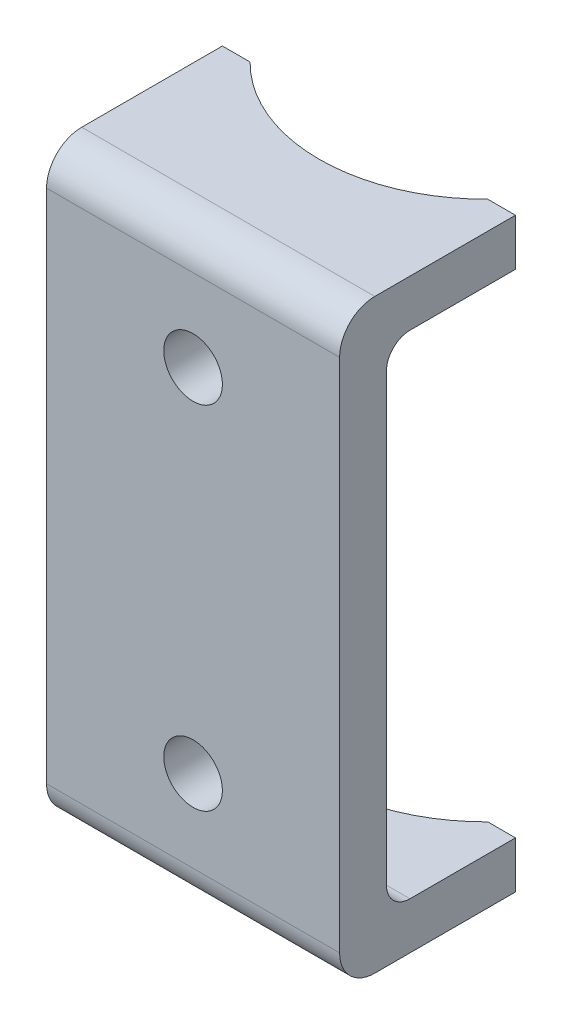
ISO-10303-21;
HEADER;
FILE_DESCRIPTION(('STEP AP214'),'2;1');
FILE_NAME('part.step','',(''),(''),'','','');
FILE_SCHEMA(('AUTOMOTIVE_DESIGN { 1 0 10303 214 1 1 1 1 }'));
ENDSEC;
DATA;
#1=APPLICATION_CONTEXT('core data for automotive mechanical design processes');
#2=APPLICATION_PROTOCOL_DEFINITION('international standard','automotive_design',2000,#1);
#3=PRODUCT_CONTEXT('',#1,'mechanical');
#4=PRODUCT('Part','Part','',(#3));
#5=PRODUCT_RELATED_PRODUCT_CATEGORY('part','',(#4));
#6=PRODUCT_DEFINITION_FORMATION('','',#4);
#7=PRODUCT_DEFINITION_CONTEXT('part definition',#1,'design');
#8=PRODUCT_DEFINITION('design','',#6,#7);
#9=PRODUCT_DEFINITION_SHAPE('','',#8);
#10=(LENGTH_UNIT() NAMED_UNIT(*) SI_UNIT(.MILLI.,.METRE.));
#11=(NAMED_UNIT(*) PLANE_ANGLE_UNIT() SI_UNIT($,.RADIAN.));
#12=(NAMED_UNIT(*) SI_UNIT($,.STERADIAN.) SOLID_ANGLE_UNIT());
#13=UNCERTAINTY_MEASURE_WITH_UNIT(LENGTH_MEASURE(1.E-05),#10,'distance_accuracy_value','');
#14=(GEOMETRIC_REPRESENTATION_CONTEXT(3) GLOBAL_UNCERTAINTY_ASSIGNED_CONTEXT((#13)) GLOBAL_UNIT_ASSIGNED_CONTEXT((#10,
#11,#12)) REPRESENTATION_CONTEXT('',''));
#15=CARTESIAN_POINT('',(0.,0.,0.));
#16=DIRECTION('',(0.,0.,1.));
#17=DIRECTION('',(1.,0.,0.));
#18=AXIS2_PLACEMENT_3D('',#15,#16,#17);
#19=CARTESIAN_POINT('',(12.5,-21.,-15.));
#20=DIRECTION('',(0.,0.,1.));
#21=DIRECTION('',(0.,-1.,0.));
#22=AXIS2_PLACEMENT_3D('',#19,#20,#21);
#23=PLANE('',#22);
#24=DIRECTION('',(-1.,0.,0.));
#25=VECTOR('',#24,1.);
#26=CARTESIAN_POINT('',(12.5,-25.,-15.));
#27=LINE('',#26,#25);
#28=CARTESIAN_POINT('',(12.5,-25.,-15.));
#29=VERTEX_POINT('',#28);
#30=CARTESIAN_POINT('',(10.1359961743084,-25.,-15.));
#31=VERTEX_POINT('',#30);
#32=EDGE_CURVE('E157',#29,#31,#27,.T.);
#33=ORIENTED_EDGE('',*,*,#32,.T.);
#34=DIRECTION('',(0.,1.,0.));
#35=VECTOR('',#34,1.);
#36=CARTESIAN_POINT('',(10.1359961743084,-25.,-15.));
#37=LINE('',#36,#35);
#38=CARTESIAN_POINT('',(10.1359961743084,-21.,-15.));
#39=VERTEX_POINT('',#38);
#40=EDGE_CURVE('E142',#31,#39,#37,.T.);
#41=ORIENTED_EDGE('',*,*,#40,.T.);
#42=DIRECTION('',(-1.,0.,0.));
#43=VECTOR('',#42,1.);
#44=CARTESIAN_POINT('',(12.5,-21.,-15.));
#45=LINE('',#44,#43);
#46=CARTESIAN_POINT('',(12.5,-21.,-15.));
#47=VERTEX_POINT('',#46);
#48=EDGE_CURVE('E165',#47,#39,#45,.T.);
#49=ORIENTED_EDGE('',*,*,#48,.F.);
#50=DIRECTION('',(0.,1.,0.));
#51=VECTOR('',#50,1.);
#52=CARTESIAN_POINT('',(12.5,-21.,-15.));
#53=LINE('',#52,#51);
#54=EDGE_CURVE('E162',#29,#47,#53,.T.);
#55=ORIENTED_EDGE('',*,*,#54,.F.);
#56=EDGE_LOOP('',(#33,#41,#49,#55));
#57=FACE_BOUND('',#56,.T.);
#58=ADVANCED_FACE('F32',(#57),#23,.F.);
#59=CARTESIAN_POINT('',(12.5,25.,-15.));
#60=DIRECTION('',(0.,0.,1.));
#61=DIRECTION('',(0.,-1.,0.));
#62=AXIS2_PLACEMENT_3D('',#59,#60,#61);
#63=PLANE('',#62);
#64=DIRECTION('',(-1.,0.,0.));
#65=VECTOR('',#64,1.);
#66=CARTESIAN_POINT('',(12.5,21.,-15.));
#67=LINE('',#66,#65);
#68=CARTESIAN_POINT('',(12.5,21.,-15.));
#69=VERTEX_POINT('',#68);
#70=CARTESIAN_POINT('',(10.1359961743084,21.,-15.));
#71=VERTEX_POINT('',#70);
#72=EDGE_CURVE('E181',#69,#71,#67,.T.);
#73=ORIENTED_EDGE('',*,*,#72,.T.);
#74=DIRECTION('',(0.,1.,0.));
#75=VECTOR('',#74,1.);
#76=CARTESIAN_POINT('',(10.1359961743084,-25.,-14.9999999999999));
#77=LINE('',#76,#75);
#78=CARTESIAN_POINT('',(10.1359961743084,25.,-15.));
#79=VERTEX_POINT('',#78);
#80=EDGE_CURVE('E263',#71,#79,#77,.T.);
#81=ORIENTED_EDGE('',*,*,#80,.T.);
#82=DIRECTION('',(-1.,0.,0.));
#83=VECTOR('',#82,1.);
#84=CARTESIAN_POINT('',(12.5,25.,-15.));
#85=LINE('',#84,#83);
#86=CARTESIAN_POINT('',(12.5,25.,-15.));
#87=VERTEX_POINT('',#86);
#88=EDGE_CURVE('E185',#87,#79,#85,.T.);
#89=ORIENTED_EDGE('',*,*,#88,.F.);
#90=DIRECTION('',(0.,1.,0.));
#91=VECTOR('',#90,1.);
#92=CARTESIAN_POINT('',(12.5,25.,-15.));
#93=LINE('',#92,#91);
#94=EDGE_CURVE('E234',#69,#87,#93,.T.);
#95=ORIENTED_EDGE('',*,*,#94,.F.);
#96=EDGE_LOOP('',(#73,#81,#89,#95));
#97=FACE_BOUND('',#96,.T.);
#98=ADVANCED_FACE('F302',(#97),#63,.F.);
#99=CARTESIAN_POINT('',(12.5,-22.,-3.00000000000001));
#100=DIRECTION('',(-1.,0.,0.));
#101=DIRECTION('',(0.,0.,1.));
#102=AXIS2_PLACEMENT_3D('',#99,#100,#101);
#103=CYLINDRICAL_SURFACE('',#102,3.);
#104=CARTESIAN_POINT('',(-12.5,-22.,-3.00000000000001));
#105=DIRECTION('',(1.,0.,0.));
#106=DIRECTION('',(0.,0.,-1.));
#107=AXIS2_PLACEMENT_3D('',#104,#105,#106);
#108=CIRCLE('',#107,3.);
#109=CARTESIAN_POINT('',(-12.5,-22.,0.));
#110=VERTEX_POINT('',#109);
#111=CARTESIAN_POINT('',(-12.5,-25.,-3.00000000000003));
#112=VERTEX_POINT('',#111);
#113=EDGE_CURVE('E225',#110,#112,#108,.T.);
#114=ORIENTED_EDGE('',*,*,#113,.T.);
#115=DIRECTION('',(-1.,0.,0.));
#116=VECTOR('',#115,1.);
#117=CARTESIAN_POINT('',(12.5,-25.,-3.00000000000003));
#118=LINE('',#117,#116);
#119=CARTESIAN_POINT('',(12.5,-25.,-3.00000000000003));
#120=VERTEX_POINT('',#119);
#121=EDGE_CURVE('E40',#120,#112,#118,.T.);
#122=ORIENTED_EDGE('',*,*,#121,.F.);
#123=CARTESIAN_POINT('',(12.5,-22.,-3.00000000000001));
#124=DIRECTION('',(1.,0.,0.));
#125=DIRECTION('',(0.,0.,-1.));
#126=AXIS2_PLACEMENT_3D('',#123,#124,#125);
#127=CIRCLE('',#126,3.);
#128=CARTESIAN_POINT('',(12.5,-22.,0.));
#129=VERTEX_POINT('',#128);
#130=EDGE_CURVE('E201',#129,#120,#127,.T.);
#131=ORIENTED_EDGE('',*,*,#130,.F.);
#132=DIRECTION('',(-1.,0.,0.));
#133=VECTOR('',#132,1.);
#134=CARTESIAN_POINT('',(12.5,-22.,0.));
#135=LINE('',#134,#133);
#136=EDGE_CURVE('E195',#129,#110,#135,.T.);
#137=ORIENTED_EDGE('',*,*,#136,.T.);
#138=EDGE_LOOP('',(#114,#122,#131,#137));
#139=FACE_BOUND('',#138,.T.);
#140=ADVANCED_FACE('F34',(#139),#103,.T.);
#141=CARTESIAN_POINT('',(12.5,-25.,-15.));
#142=DIRECTION('',(0.,1.,0.));
#143=DIRECTION('',(0.,0.,1.));
#144=AXIS2_PLACEMENT_3D('',#141,#142,#143);
#145=PLANE('',#144);
#146=CARTESIAN_POINT('',(-10.1359961743084,-25.,-15.));
#147=VERTEX_POINT('',#146);
#148=CARTESIAN_POINT('',(-12.5,-25.,-15.));
#149=VERTEX_POINT('',#148);
#150=EDGE_CURVE('E160',#147,#149,#27,.T.);
#151=ORIENTED_EDGE('',*,*,#150,.F.);
#152=CARTESIAN_POINT('',(0.,-25.,-25.));
#153=DIRECTION('',(0.,1.,0.));
#154=DIRECTION('',(0.,0.,1.));
#155=AXIS2_PLACEMENT_3D('',#152,#153,#154);
#156=CIRCLE('',#155,14.2386241767102);
#157=EDGE_CURVE('E145',#147,#31,#156,.T.);
#158=ORIENTED_EDGE('',*,*,#157,.T.);
#159=ORIENTED_EDGE('',*,*,#32,.F.);
#160=DIRECTION('',(0.,0.,-1.));
#161=VECTOR('',#160,1.);
#162=CARTESIAN_POINT('',(12.5,-25.,-15.));
#163=LINE('',#162,#161);
#164=EDGE_CURVE('E247',#120,#29,#163,.T.);
#165=ORIENTED_EDGE('',*,*,#164,.F.);
#166=ORIENTED_EDGE('',*,*,#121,.T.);
#167=DIRECTION('',(0.,0.,-1.));
#168=VECTOR('',#167,1.);
#169=CARTESIAN_POINT('',(-12.5,-25.,-15.));
#170=LINE('',#169,#168);
#171=EDGE_CURVE('E223',#112,#149,#170,.T.);
#172=ORIENTED_EDGE('',*,*,#171,.T.);
#173=EDGE_LOOP('',(#151,#158,#159,#165,#166,#172));
#174=FACE_BOUND('',#173,.T.);
#175=ADVANCED_FACE('F156',(#174),#145,.F.);
#176=CARTESIAN_POINT('',(-10.1359961743084,-21.,-15.));
#177=VERTEX_POINT('',#176);
#178=CARTESIAN_POINT('',(-12.5,-21.,-15.));
#179=VERTEX_POINT('',#178);
#180=EDGE_CURVE('E168',#177,#179,#45,.T.);
#181=ORIENTED_EDGE('',*,*,#180,.F.);
#182=DIRECTION('',(0.,1.,0.));
#183=VECTOR('',#182,1.);
#184=CARTESIAN_POINT('',(-10.1359961743084,-25.,-15.));
#185=LINE('',#184,#183);
#186=EDGE_CURVE('E47',#177,#147,#185,.F.);
#187=ORIENTED_EDGE('',*,*,#186,.T.);
#188=ORIENTED_EDGE('',*,*,#150,.T.);
#189=DIRECTION('',(0.,1.,0.));
#190=VECTOR('',#189,1.);
#191=CARTESIAN_POINT('',(-12.5,-21.,-15.));
#192=LINE('',#191,#190);
#193=EDGE_CURVE('E220',#149,#179,#192,.T.);
#194=ORIENTED_EDGE('',*,*,#193,.T.);
#195=EDGE_LOOP('',(#181,#187,#188,#194));
#196=FACE_BOUND('',#195,.T.);
#197=ADVANCED_FACE('F316',(#196),#23,.F.);
#198=CARTESIAN_POINT('',(12.5,-21.,-6.00000000000002));
#199=DIRECTION('',(0.,-1.,0.));
#200=DIRECTION('',(0.,0.,-1.));
#201=AXIS2_PLACEMENT_3D('',#198,#199,#200);
#202=PLANE('',#201);
#203=ORIENTED_EDGE('',*,*,#48,.T.);
#204=CARTESIAN_POINT('',(0.,-21.,-25.));
#205=DIRECTION('',(0.,-1.,0.));
#206=DIRECTION('',(0.,0.,-1.));
#207=AXIS2_PLACEMENT_3D('',#204,#205,#206);
#208=CIRCLE('',#207,14.2386241767102);
#209=EDGE_CURVE('E146',#39,#177,#208,.T.);
#210=ORIENTED_EDGE('',*,*,#209,.T.);
#211=ORIENTED_EDGE('',*,*,#180,.T.);
#212=DIRECTION('',(0.,0.,1.));
#213=VECTOR('',#212,1.);
#214=CARTESIAN_POINT('',(-12.5,-21.,-6.00000000000002));
#215=LINE('',#214,#213);
#216=CARTESIAN_POINT('',(-12.5,-21.,-6.00000000000002));
#217=VERTEX_POINT('',#216);
#218=EDGE_CURVE('E218',#179,#217,#215,.T.);
#219=ORIENTED_EDGE('',*,*,#218,.T.);
#220=DIRECTION('',(-1.,0.,0.));
#221=VECTOR('',#220,1.);
#222=CARTESIAN_POINT('',(12.5,-21.,-6.00000000000002));
#223=LINE('',#222,#221);
#224=CARTESIAN_POINT('',(12.5,-21.,-6.00000000000002));
#225=VERTEX_POINT('',#224);
#226=EDGE_CURVE('E169',#225,#217,#223,.T.);
#227=ORIENTED_EDGE('',*,*,#226,.F.);
#228=DIRECTION('',(0.,0.,1.));
#229=VECTOR('',#228,1.);
#230=CARTESIAN_POINT('',(12.5,-21.,-6.00000000000002));
#231=LINE('',#230,#229);
#232=EDGE_CURVE('E244',#47,#225,#231,.T.);
#233=ORIENTED_EDGE('',*,*,#232,.F.);
#234=EDGE_LOOP('',(#203,#210,#211,#219,#227,#233));
#235=FACE_BOUND('',#234,.T.);
#236=ADVANCED_FACE('F323',(#235),#202,.F.);
#237=CARTESIAN_POINT('',(12.5,-19.,-6.00000000000001));
#238=DIRECTION('',(-1.,0.,0.));
#239=DIRECTION('',(0.,0.,1.));
#240=AXIS2_PLACEMENT_3D('',#237,#238,#239);
#241=CYLINDRICAL_SURFACE('',#240,2.);
#242=CARTESIAN_POINT('',(-12.5,-19.,-6.00000000000001));
#243=DIRECTION('',(-1.,0.,0.));
#244=DIRECTION('',(0.,0.,-1.));
#245=AXIS2_PLACEMENT_3D('',#242,#243,#244);
#246=CIRCLE('',#245,2.);
#247=CARTESIAN_POINT('',(-12.5,-19.,-4.00000000000001));
#248=VERTEX_POINT('',#247);
#249=EDGE_CURVE('E216',#217,#248,#246,.T.);
#250=ORIENTED_EDGE('',*,*,#249,.T.);
#251=DIRECTION('',(-1.,0.,0.));
#252=VECTOR('',#251,1.);
#253=CARTESIAN_POINT('',(12.5,-19.,-4.00000000000001));
#254=LINE('',#253,#252);
#255=CARTESIAN_POINT('',(12.5,-19.,-4.00000000000001));
#256=VERTEX_POINT('',#255);
#257=EDGE_CURVE('E172',#256,#248,#254,.T.);
#258=ORIENTED_EDGE('',*,*,#257,.F.);
#259=CARTESIAN_POINT('',(12.5,-19.,-6.00000000000001));
#260=DIRECTION('',(-1.,0.,0.));
#261=DIRECTION('',(0.,0.,-1.));
#262=AXIS2_PLACEMENT_3D('',#259,#260,#261);
#263=CIRCLE('',#262,2.);
#264=EDGE_CURVE('E242',#225,#256,#263,.T.);
#265=ORIENTED_EDGE('',*,*,#264,.F.);
#266=ORIENTED_EDGE('',*,*,#226,.T.);
#267=EDGE_LOOP('',(#250,#258,#265,#266));
#268=FACE_BOUND('',#267,.T.);
#269=ADVANCED_FACE('F329',(#268),#241,.F.);
#270=CARTESIAN_POINT('',(12.5,19.,-4.));
#271=DIRECTION('',(0.,0.,1.));
#272=DIRECTION('',(0.,-1.,0.));
#273=AXIS2_PLACEMENT_3D('',#270,#271,#272);
#274=PLANE('',#273);
#275=CARTESIAN_POINT('',(0.,-15.,-4.00000000000001));
#276=DIRECTION('',(0.,0.,1.));
#277=DIRECTION('',(0.,-1.,0.));
#278=AXIS2_PLACEMENT_3D('',#275,#276,#277);
#279=CIRCLE('',#278,2.5);
#280=CARTESIAN_POINT('',(0.,-17.5,-4.00000000000001));
#281=VERTEX_POINT('',#280);
#282=EDGE_CURVE('E256',#281,#281,#279,.F.);
#283=ORIENTED_EDGE('',*,*,#282,.F.);
#284=EDGE_LOOP('',(#283));
#285=FACE_BOUND('',#284,.T.);
#286=CARTESIAN_POINT('',(0.,15.,-4.));
#287=DIRECTION('',(0.,0.,1.));
#288=DIRECTION('',(0.,-1.,0.));
#289=AXIS2_PLACEMENT_3D('',#286,#287,#288);
#290=CIRCLE('',#289,2.5);
#291=CARTESIAN_POINT('',(0.,12.5,-4.));
#292=VERTEX_POINT('',#291);
#293=EDGE_CURVE('E228',#292,#292,#290,.F.);
#294=ORIENTED_EDGE('',*,*,#293,.F.);
#295=EDGE_LOOP('',(#294));
#296=FACE_BOUND('',#295,.T.);
#297=DIRECTION('',(0.,1.,0.));
#298=VECTOR('',#297,1.);
#299=CARTESIAN_POINT('',(-12.5,19.,-4.));
#300=LINE('',#299,#298);
#301=CARTESIAN_POINT('',(-12.5,19.,-4.));
#302=VERTEX_POINT('',#301);
#303=EDGE_CURVE('E214',#248,#302,#300,.T.);
#304=ORIENTED_EDGE('',*,*,#303,.T.);
#305=DIRECTION('',(-1.,0.,0.));
#306=VECTOR('',#305,1.);
#307=CARTESIAN_POINT('',(12.5,19.,-4.));
#308=LINE('',#307,#306);
#309=CARTESIAN_POINT('',(12.5,19.,-4.));
#310=VERTEX_POINT('',#309);
#311=EDGE_CURVE('E175',#310,#302,#308,.T.);
#312=ORIENTED_EDGE('',*,*,#311,.F.);
#313=DIRECTION('',(0.,1.,0.));
#314=VECTOR('',#313,1.);
#315=CARTESIAN_POINT('',(12.5,19.,-4.));
#316=LINE('',#315,#314);
#317=EDGE_CURVE('E240',#256,#310,#316,.T.);
#318=ORIENTED_EDGE('',*,*,#317,.F.);
#319=ORIENTED_EDGE('',*,*,#257,.T.);
#320=EDGE_LOOP('',(#304,#312,#318,#319));
#321=FACE_BOUND('',#320,.T.);
#322=ADVANCED_FACE('F346',(#285,#296,#321),#274,.F.);
#323=CARTESIAN_POINT('',(12.5,19.,-6.));
#324=DIRECTION('',(-1.,0.,0.));
#325=DIRECTION('',(0.,0.,1.));
#326=AXIS2_PLACEMENT_3D('',#323,#324,#325);
#327=CYLINDRICAL_SURFACE('',#326,2.);
#328=CARTESIAN_POINT('',(-12.5,19.,-6.));
#329=DIRECTION('',(-1.,0.,0.));
#330=DIRECTION('',(0.,0.,1.));
#331=AXIS2_PLACEMENT_3D('',#328,#329,#330);
#332=CIRCLE('',#331,2.);
#333=CARTESIAN_POINT('',(-12.5,21.,-6.00000000000002));
#334=VERTEX_POINT('',#333);
#335=EDGE_CURVE('E212',#302,#334,#332,.T.);
#336=ORIENTED_EDGE('',*,*,#335,.T.);
#337=DIRECTION('',(-1.,0.,0.));
#338=VECTOR('',#337,1.);
#339=CARTESIAN_POINT('',(12.5,21.,-6.00000000000002));
#340=LINE('',#339,#338);
#341=CARTESIAN_POINT('',(12.5,21.,-6.00000000000002));
#342=VERTEX_POINT('',#341);
#343=EDGE_CURVE('E178',#342,#334,#340,.T.);
#344=ORIENTED_EDGE('',*,*,#343,.F.);
#345=CARTESIAN_POINT('',(12.5,19.,-6.));
#346=DIRECTION('',(-1.,0.,0.));
#347=DIRECTION('',(0.,0.,1.));
#348=AXIS2_PLACEMENT_3D('',#345,#346,#347);
#349=CIRCLE('',#348,2.);
#350=EDGE_CURVE('E238',#310,#342,#349,.T.);
#351=ORIENTED_EDGE('',*,*,#350,.F.);
#352=ORIENTED_EDGE('',*,*,#311,.T.);
#353=EDGE_LOOP('',(#336,#344,#351,#352));
#354=FACE_BOUND('',#353,.T.);
#355=ADVANCED_FACE('F350',(#354),#327,.F.);
#356=CARTESIAN_POINT('',(12.5,21.,-6.00000000000002));
#357=DIRECTION('',(0.,1.,0.));
#358=DIRECTION('',(0.,0.,1.));
#359=AXIS2_PLACEMENT_3D('',#356,#357,#358);
#360=PLANE('',#359);
#361=CARTESIAN_POINT('',(-10.1359961743084,21.,-14.9999999999999));
#362=VERTEX_POINT('',#361);
#363=CARTESIAN_POINT('',(-12.5,21.,-15.));
#364=VERTEX_POINT('',#363);
#365=EDGE_CURVE('E184',#362,#364,#67,.T.);
#366=ORIENTED_EDGE('',*,*,#365,.F.);
#367=CARTESIAN_POINT('',(0.,21.,-25.));
#368=DIRECTION('',(0.,1.,0.));
#369=DIRECTION('',(0.,0.,1.));
#370=AXIS2_PLACEMENT_3D('',#367,#368,#369);
#371=CIRCLE('',#370,14.2386241767102);
#372=EDGE_CURVE('E266',#362,#71,#371,.T.);
#373=ORIENTED_EDGE('',*,*,#372,.T.);
#374=ORIENTED_EDGE('',*,*,#72,.F.);
#375=DIRECTION('',(0.,0.,-1.));
#376=VECTOR('',#375,1.);
#377=CARTESIAN_POINT('',(12.5,21.,-6.00000000000002));
#378=LINE('',#377,#376);
#379=EDGE_CURVE('E236',#342,#69,#378,.T.);
#380=ORIENTED_EDGE('',*,*,#379,.F.);
#381=ORIENTED_EDGE('',*,*,#343,.T.);
#382=DIRECTION('',(0.,0.,-1.));
#383=VECTOR('',#382,1.);
#384=CARTESIAN_POINT('',(-12.5,21.,-6.00000000000002));
#385=LINE('',#384,#383);
#386=EDGE_CURVE('E209',#334,#364,#385,.T.);
#387=ORIENTED_EDGE('',*,*,#386,.T.);
#388=EDGE_LOOP('',(#366,#373,#374,#380,#381,#387));
#389=FACE_BOUND('',#388,.T.);
#390=ADVANCED_FACE('F274',(#389),#360,.F.);
#391=CARTESIAN_POINT('',(-10.1359961743084,25.,-15.));
#392=VERTEX_POINT('',#391);
#393=CARTESIAN_POINT('',(-12.5,25.,-15.));
#394=VERTEX_POINT('',#393);
#395=EDGE_CURVE('E188',#392,#394,#85,.T.);
#396=ORIENTED_EDGE('',*,*,#395,.F.);
#397=DIRECTION('',(0.,1.,0.));
#398=VECTOR('',#397,1.);
#399=CARTESIAN_POINT('',(-10.1359961743084,-25.,-14.9999999999999));
#400=LINE('',#399,#398);
#401=EDGE_CURVE('E55',#392,#362,#400,.F.);
#402=ORIENTED_EDGE('',*,*,#401,.T.);
#403=ORIENTED_EDGE('',*,*,#365,.T.);
#404=DIRECTION('',(0.,1.,0.));
#405=VECTOR('',#404,1.);
#406=CARTESIAN_POINT('',(-12.5,25.,-15.));
#407=LINE('',#406,#405);
#408=EDGE_CURVE('E206',#364,#394,#407,.T.);
#409=ORIENTED_EDGE('',*,*,#408,.T.);
#410=EDGE_LOOP('',(#396,#402,#403,#409));
#411=FACE_BOUND('',#410,.T.);
#412=ADVANCED_FACE('F272',(#411),#63,.F.);
#413=CARTESIAN_POINT('',(12.5,25.,-15.));
#414=DIRECTION('',(0.,-1.,0.));
#415=DIRECTION('',(0.,0.,-1.));
#416=AXIS2_PLACEMENT_3D('',#413,#414,#415);
#417=PLANE('',#416);
#418=ORIENTED_EDGE('',*,*,#88,.T.);
#419=CARTESIAN_POINT('',(0.,25.,-25.));
#420=DIRECTION('',(0.,-1.,0.));
#421=DIRECTION('',(0.,0.,-1.));
#422=AXIS2_PLACEMENT_3D('',#419,#420,#421);
#423=CIRCLE('',#422,14.2386241767102);
#424=EDGE_CURVE('E11',#79,#392,#423,.T.);
#425=ORIENTED_EDGE('',*,*,#424,.T.);
#426=ORIENTED_EDGE('',*,*,#395,.T.);
#427=DIRECTION('',(0.,0.,1.));
#428=VECTOR('',#427,1.);
#429=CARTESIAN_POINT('',(-12.5,25.,-15.));
#430=LINE('',#429,#428);
#431=CARTESIAN_POINT('',(-12.5,25.,-3.00000000000003));
#432=VERTEX_POINT('',#431);
#433=EDGE_CURVE('E204',#394,#432,#430,.T.);
#434=ORIENTED_EDGE('',*,*,#433,.T.);
#435=DIRECTION('',(-1.,0.,0.));
#436=VECTOR('',#435,1.);
#437=CARTESIAN_POINT('',(12.5,25.,-3.00000000000003));
#438=LINE('',#437,#436);
#439=CARTESIAN_POINT('',(12.5,25.,-3.00000000000003));
#440=VERTEX_POINT('',#439);
#441=EDGE_CURVE('E189',#440,#432,#438,.T.);
#442=ORIENTED_EDGE('',*,*,#441,.F.);
#443=DIRECTION('',(0.,0.,1.));
#444=VECTOR('',#443,1.);
#445=CARTESIAN_POINT('',(12.5,25.,-15.));
#446=LINE('',#445,#444);
#447=EDGE_CURVE('E232',#87,#440,#446,.T.);
#448=ORIENTED_EDGE('',*,*,#447,.F.);
#449=EDGE_LOOP('',(#418,#425,#426,#434,#442,#448));
#450=FACE_BOUND('',#449,.T.);
#451=ADVANCED_FACE('F289',(#450),#417,.F.);
#452=CARTESIAN_POINT('',(12.5,22.,-3.00000000000001));
#453=DIRECTION('',(-1.,0.,0.));
#454=DIRECTION('',(0.,0.,1.));
#455=AXIS2_PLACEMENT_3D('',#452,#453,#454);
#456=CYLINDRICAL_SURFACE('',#455,3.);
#457=CARTESIAN_POINT('',(-12.5,22.,-3.00000000000001));
#458=DIRECTION('',(1.,0.,0.));
#459=DIRECTION('',(0.,0.,1.));
#460=AXIS2_PLACEMENT_3D('',#457,#458,#459);
#461=CIRCLE('',#460,3.);
#462=CARTESIAN_POINT('',(-12.5,22.,0.));
#463=VERTEX_POINT('',#462);
#464=EDGE_CURVE('E202',#432,#463,#461,.T.);
#465=ORIENTED_EDGE('',*,*,#464,.T.);
#466=DIRECTION('',(-1.,0.,0.));
#467=VECTOR('',#466,1.);
#468=CARTESIAN_POINT('',(12.5,22.,0.));
#469=LINE('',#468,#467);
#470=CARTESIAN_POINT('',(12.5,22.,0.));
#471=VERTEX_POINT('',#470);
#472=EDGE_CURVE('E192',#471,#463,#469,.T.);
#473=ORIENTED_EDGE('',*,*,#472,.F.);
#474=CARTESIAN_POINT('',(12.5,22.,-3.00000000000001));
#475=DIRECTION('',(1.,0.,0.));
#476=DIRECTION('',(0.,0.,1.));
#477=AXIS2_PLACEMENT_3D('',#474,#475,#476);
#478=CIRCLE('',#477,3.);
#479=EDGE_CURVE('E230',#440,#471,#478,.T.);
#480=ORIENTED_EDGE('',*,*,#479,.F.);
#481=ORIENTED_EDGE('',*,*,#441,.T.);
#482=EDGE_LOOP('',(#465,#473,#480,#481));
#483=FACE_BOUND('',#482,.T.);
#484=ADVANCED_FACE('F293',(#483),#456,.T.);
#485=CARTESIAN_POINT('',(12.5,22.,0.));
#486=DIRECTION('',(0.,0.,-1.));
#487=DIRECTION('',(-1.,0.,0.));
#488=AXIS2_PLACEMENT_3D('',#485,#486,#487);
#489=PLANE('',#488);
#490=CARTESIAN_POINT('',(0.,-15.,0.));
#491=DIRECTION('',(0.,0.,1.));
#492=DIRECTION('',(1.,0.,0.));
#493=AXIS2_PLACEMENT_3D('',#490,#491,#492);
#494=CIRCLE('',#493,2.5);
#495=CARTESIAN_POINT('',(2.50000000000001,-15.,0.));
#496=VERTEX_POINT('',#495);
#497=EDGE_CURVE('E151',#496,#496,#494,.T.);
#498=ORIENTED_EDGE('',*,*,#497,.F.);
#499=EDGE_LOOP('',(#498));
#500=FACE_BOUND('',#499,.T.);
#501=CARTESIAN_POINT('',(0.,15.,0.));
#502=DIRECTION('',(0.,0.,1.));
#503=DIRECTION('',(1.,0.,0.));
#504=AXIS2_PLACEMENT_3D('',#501,#502,#503);
#505=CIRCLE('',#504,2.5);
#506=CARTESIAN_POINT('',(2.5,15.,0.));
#507=VERTEX_POINT('',#506);
#508=EDGE_CURVE('E253',#507,#507,#505,.T.);
#509=ORIENTED_EDGE('',*,*,#508,.F.);
#510=EDGE_LOOP('',(#509));
#511=FACE_BOUND('',#510,.T.);
#512=DIRECTION('',(0.,-1.,0.));
#513=VECTOR('',#512,1.);
#514=CARTESIAN_POINT('',(-12.5,22.,0.));
#515=LINE('',#514,#513);
#516=EDGE_CURVE('E199',#463,#110,#515,.T.);
#517=ORIENTED_EDGE('',*,*,#516,.T.);
#518=ORIENTED_EDGE('',*,*,#136,.F.);
#519=DIRECTION('',(0.,-1.,0.));
#520=VECTOR('',#519,1.);
#521=CARTESIAN_POINT('',(12.5,22.,0.));
#522=LINE('',#521,#520);
#523=EDGE_CURVE('E198',#471,#129,#522,.T.);
#524=ORIENTED_EDGE('',*,*,#523,.F.);
#525=ORIENTED_EDGE('',*,*,#472,.T.);
#526=EDGE_LOOP('',(#517,#518,#524,#525));
#527=FACE_BOUND('',#526,.T.);
#528=ADVANCED_FACE('F382',(#500,#511,#527),#489,.F.);
#529=CARTESIAN_POINT('',(12.5,-22.,-3.00000000000001));
#530=DIRECTION('',(1.,0.,0.));
#531=DIRECTION('',(0.,0.,-1.));
#532=AXIS2_PLACEMENT_3D('',#529,#530,#531);
#533=PLANE('',#532);
#534=ORIENTED_EDGE('',*,*,#130,.T.);
#535=ORIENTED_EDGE('',*,*,#164,.T.);
#536=ORIENTED_EDGE('',*,*,#54,.T.);
#537=ORIENTED_EDGE('',*,*,#232,.T.);
#538=ORIENTED_EDGE('',*,*,#264,.T.);
#539=ORIENTED_EDGE('',*,*,#317,.T.);
#540=ORIENTED_EDGE('',*,*,#350,.T.);
#541=ORIENTED_EDGE('',*,*,#379,.T.);
#542=ORIENTED_EDGE('',*,*,#94,.T.);
#543=ORIENTED_EDGE('',*,*,#447,.T.);
#544=ORIENTED_EDGE('',*,*,#479,.T.);
#545=ORIENTED_EDGE('',*,*,#523,.T.);
#546=EDGE_LOOP('',(#534,#535,#536,#537,#538,#539,#540,#541,#542,#543,#544,#545));
#547=FACE_BOUND('',#546,.T.);
#548=ADVANCED_FACE('F297',(#547),#533,.T.);
#549=CARTESIAN_POINT('',(-12.5,-22.,-3.00000000000001));
#550=DIRECTION('',(1.,0.,0.));
#551=DIRECTION('',(0.,0.,-1.));
#552=AXIS2_PLACEMENT_3D('',#549,#550,#551);
#553=PLANE('',#552);
#554=ORIENTED_EDGE('',*,*,#113,.F.);
#555=ORIENTED_EDGE('',*,*,#516,.F.);
#556=ORIENTED_EDGE('',*,*,#464,.F.);
#557=ORIENTED_EDGE('',*,*,#433,.F.);
#558=ORIENTED_EDGE('',*,*,#408,.F.);
#559=ORIENTED_EDGE('',*,*,#386,.F.);
#560=ORIENTED_EDGE('',*,*,#335,.F.);
#561=ORIENTED_EDGE('',*,*,#303,.F.);
#562=ORIENTED_EDGE('',*,*,#249,.F.);
#563=ORIENTED_EDGE('',*,*,#218,.F.);
#564=ORIENTED_EDGE('',*,*,#193,.F.);
#565=ORIENTED_EDGE('',*,*,#171,.F.);
#566=EDGE_LOOP('',(#554,#555,#556,#557,#558,#559,#560,#561,#562,#563,#564,#565));
#567=FACE_BOUND('',#566,.T.);
#568=ADVANCED_FACE('F284',(#567),#553,.F.);
#569=CARTESIAN_POINT('',(0.,15.,-11.0710678118655));
#570=DIRECTION('',(0.,0.,1.));
#571=DIRECTION('',(1.,0.,0.));
#572=AXIS2_PLACEMENT_3D('',#569,#570,#571);
#573=CYLINDRICAL_SURFACE('',#572,2.5);
#574=ORIENTED_EDGE('',*,*,#293,.T.);
#575=EDGE_LOOP('',(#574));
#576=FACE_BOUND('',#575,.T.);
#577=ORIENTED_EDGE('',*,*,#508,.T.);
#578=EDGE_LOOP('',(#577));
#579=FACE_BOUND('',#578,.T.);
#580=ADVANCED_FACE('F311',(#576,#579),#573,.F.);
#581=CARTESIAN_POINT('',(0.,-15.,-11.0710678118655));
#582=DIRECTION('',(0.,0.,1.));
#583=DIRECTION('',(1.,0.,0.));
#584=AXIS2_PLACEMENT_3D('',#581,#582,#583);
#585=CYLINDRICAL_SURFACE('',#584,2.5);
#586=ORIENTED_EDGE('',*,*,#282,.T.);
#587=EDGE_LOOP('',(#586));
#588=FACE_BOUND('',#587,.T.);
#589=ORIENTED_EDGE('',*,*,#497,.T.);
#590=EDGE_LOOP('',(#589));
#591=FACE_BOUND('',#590,.T.);
#592=ADVANCED_FACE('F305',(#588,#591),#585,.F.);
#593=CARTESIAN_POINT('',(0.,-25.,-25.));
#594=DIRECTION('',(0.,1.,0.));
#595=DIRECTION('',(0.,0.,1.));
#596=AXIS2_PLACEMENT_3D('',#593,#594,#595);
#597=CYLINDRICAL_SURFACE('',#596,14.2386241767102);
#598=ORIENTED_EDGE('',*,*,#372,.F.);
#599=ORIENTED_EDGE('',*,*,#401,.F.);
#600=ORIENTED_EDGE('',*,*,#424,.F.);
#601=ORIENTED_EDGE('',*,*,#80,.F.);
#602=EDGE_LOOP('',(#598,#599,#600,#601));
#603=FACE_BOUND('',#602,.T.);
#604=ADVANCED_FACE('F303',(#603),#597,.F.);
#605=ORIENTED_EDGE('',*,*,#157,.F.);
#606=ORIENTED_EDGE('',*,*,#186,.F.);
#607=ORIENTED_EDGE('',*,*,#209,.F.);
#608=ORIENTED_EDGE('',*,*,#40,.F.);
#609=EDGE_LOOP('',(#605,#606,#607,#608));
#610=FACE_BOUND('',#609,.T.);
#611=ADVANCED_FACE('F144',(#610),#597,.F.);
#612=CLOSED_SHELL('',(#58,#98,#140,#175,#197,#236,#269,#322,#355,#390,#412,#451,#484,#528,#548,
#568,#580,#592,#604,#611));
#613=MANIFOLD_SOLID_BREP('B2',#612);
#614=ADVANCED_BREP_SHAPE_REPRESENTATION('',(#18,#613),#14);
#615=SHAPE_DEFINITION_REPRESENTATION(#9,#614);
ENDSEC;
END-ISO-10303-21;
